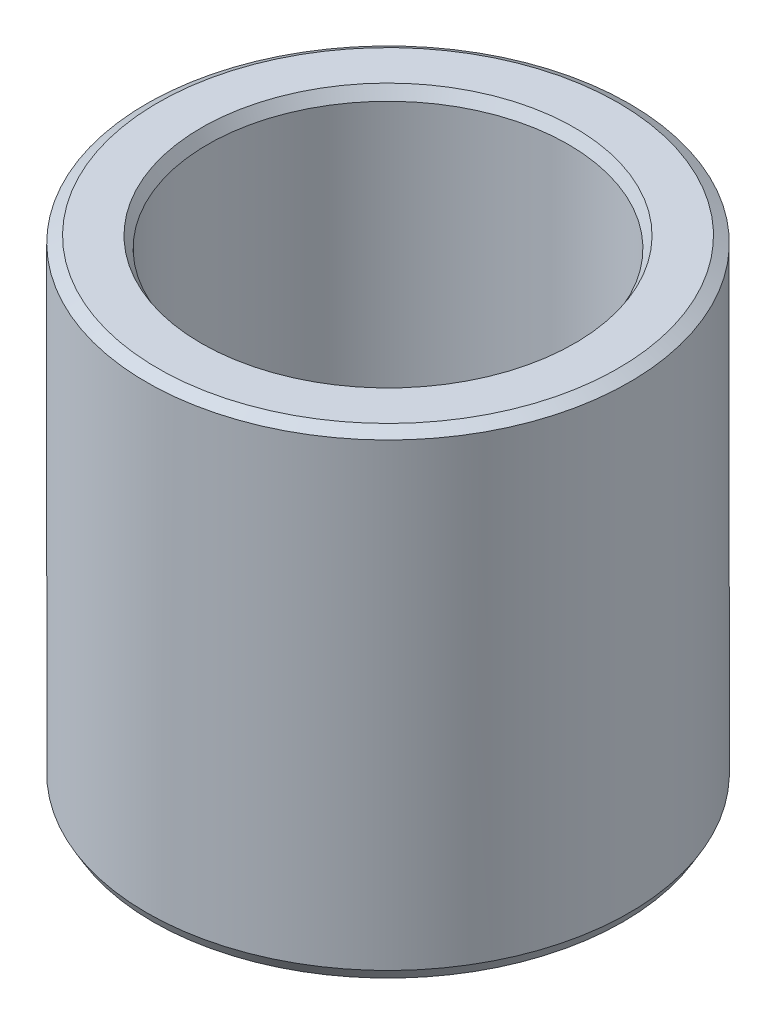
ISO-10303-21;
HEADER;
FILE_DESCRIPTION(('STEP AP214'),'2;1');
FILE_NAME('part.step','',(''),(''),'','','');
FILE_SCHEMA(('AUTOMOTIVE_DESIGN { 1 0 10303 214 1 1 1 1 }'));
ENDSEC;
DATA;
#1=APPLICATION_CONTEXT('core data for automotive mechanical design processes');
#2=APPLICATION_PROTOCOL_DEFINITION('international standard','automotive_design',2000,#1);
#3=PRODUCT_CONTEXT('',#1,'mechanical');
#4=PRODUCT('Part','Part','',(#3));
#5=PRODUCT_RELATED_PRODUCT_CATEGORY('part','',(#4));
#6=PRODUCT_DEFINITION_FORMATION('','',#4);
#7=PRODUCT_DEFINITION_CONTEXT('part definition',#1,'design');
#8=PRODUCT_DEFINITION('design','',#6,#7);
#9=PRODUCT_DEFINITION_SHAPE('','',#8);
#10=(LENGTH_UNIT() NAMED_UNIT(*) SI_UNIT(.MILLI.,.METRE.));
#11=(NAMED_UNIT(*) PLANE_ANGLE_UNIT() SI_UNIT($,.RADIAN.));
#12=(NAMED_UNIT(*) SI_UNIT($,.STERADIAN.) SOLID_ANGLE_UNIT());
#13=UNCERTAINTY_MEASURE_WITH_UNIT(LENGTH_MEASURE(1.E-05),#10,'distance_accuracy_value','');
#14=(GEOMETRIC_REPRESENTATION_CONTEXT(3) GLOBAL_UNCERTAINTY_ASSIGNED_CONTEXT((#13)) GLOBAL_UNIT_ASSIGNED_CONTEXT((#10,
#11,#12)) REPRESENTATION_CONTEXT('',''));
#15=CARTESIAN_POINT('',(0.,0.,0.));
#16=DIRECTION('',(0.,0.,1.));
#17=DIRECTION('',(1.,0.,0.));
#18=AXIS2_PLACEMENT_3D('',#15,#16,#17);
#19=CARTESIAN_POINT('',(0.,113.649586264909,0.));
#20=DIRECTION('',(0.,-1.,0.));
#21=DIRECTION('',(0.,0.,-1.));
#22=AXIS2_PLACEMENT_3D('',#19,#20,#21);
#23=CYLINDRICAL_SURFACE('',#22,57.5);
#24=CARTESIAN_POINT('',(0.,2.66282835838898,0.));
#25=DIRECTION('',(0.,1.,0.));
#26=DIRECTION('',(0.,0.,1.));
#27=AXIS2_PLACEMENT_3D('',#24,#25,#26);
#28=CIRCLE('',#27,57.5);
#29=CARTESIAN_POINT('',(0.,2.66282835838896,-57.5));
#30=VERTEX_POINT('',#29);
#31=EDGE_CURVE('E10',#30,#30,#28,.T.);
#32=CARTESIAN_POINT('',(0.,112.112201595387,0.));
#33=DIRECTION('',(0.,1.,0.));
#34=DIRECTION('',(0.,0.,1.));
#35=AXIS2_PLACEMENT_3D('',#32,#33,#34);
#36=CIRCLE('',#35,57.5);
#37=CARTESIAN_POINT('',(0.,112.112201595387,-57.5));
#38=VERTEX_POINT('',#37);
#39=EDGE_CURVE('E50',#38,#38,#36,.F.);
#40=CARTESIAN_POINT('',(0.,2.66282835838896,-57.5));
#41=CARTESIAN_POINT('',(0.,3.80292599627436,-57.5));
#42=CARTESIAN_POINT('',(0.,4.94302363415976,-57.5));
#43=CARTESIAN_POINT('',(0.,7.22321890993056,-57.5));
#44=CARTESIAN_POINT('',(0.,8.36331654781595,-57.5));
#45=CARTESIAN_POINT('',(0.,10.6435118235867,-57.5));
#46=CARTESIAN_POINT('',(0.,11.7836094614721,-57.5));
#47=CARTESIAN_POINT('',(0.,14.0638047372429,-57.5));
#48=CARTESIAN_POINT('',(0.,15.2039023751283,-57.5));
#49=CARTESIAN_POINT('',(0.,17.4840976508991,-57.5));
#50=CARTESIAN_POINT('',(0.,18.6241952887845,-57.5));
#51=CARTESIAN_POINT('',(0.,20.9043905645553,-57.5));
#52=CARTESIAN_POINT('',(0.,22.0444882024407,-57.5));
#53=CARTESIAN_POINT('',(0.,24.3246834782115,-57.5));
#54=CARTESIAN_POINT('',(0.,25.4647811160969,-57.5));
#55=CARTESIAN_POINT('',(0.,27.7449763918677,-57.5));
#56=CARTESIAN_POINT('',(0.,28.8850740297531,-57.5));
#57=CARTESIAN_POINT('',(0.,31.1652693055239,-57.5));
#58=CARTESIAN_POINT('',(0.,32.3053669434093,-57.5));
#59=CARTESIAN_POINT('',(0.,34.5855622191801,-57.5));
#60=CARTESIAN_POINT('',(0.,35.7256598570655,-57.5));
#61=CARTESIAN_POINT('',(0.,38.0058551328363,-57.5));
#62=CARTESIAN_POINT('',(0.,39.1459527707217,-57.5));
#63=CARTESIAN_POINT('',(0.,41.4261480464925,-57.5));
#64=CARTESIAN_POINT('',(0.,42.5662456843779,-57.5));
#65=CARTESIAN_POINT('',(0.,44.8464409601487,-57.5));
#66=CARTESIAN_POINT('',(0.,45.9865385980341,-57.5));
#67=CARTESIAN_POINT('',(0.,48.2667338738049,-57.5));
#68=CARTESIAN_POINT('',(0.,49.4068315116903,-57.5));
#69=CARTESIAN_POINT('',(0.,51.6870267874611,-57.5));
#70=CARTESIAN_POINT('',(0.,52.8271244253465,-57.5));
#71=CARTESIAN_POINT('',(0.,55.1073197011173,-57.5));
#72=CARTESIAN_POINT('',(0.,56.2474173390027,-57.5));
#73=CARTESIAN_POINT('',(0.,58.5276126147735,-57.5));
#74=CARTESIAN_POINT('',(0.,59.6677102526588,-57.5));
#75=CARTESIAN_POINT('',(0.,61.9479055284296,-57.5));
#76=CARTESIAN_POINT('',(0.,63.088003166315,-57.5));
#77=CARTESIAN_POINT('',(0.,65.3681984420858,-57.5));
#78=CARTESIAN_POINT('',(0.,66.5082960799712,-57.5));
#79=CARTESIAN_POINT('',(0.,68.788491355742,-57.5));
#80=CARTESIAN_POINT('',(0.,69.9285889936274,-57.5));
#81=CARTESIAN_POINT('',(0.,72.2087842693982,-57.5));
#82=CARTESIAN_POINT('',(0.,73.3488819072836,-57.5));
#83=CARTESIAN_POINT('',(0.,75.6290771830544,-57.5));
#84=CARTESIAN_POINT('',(0.,76.7691748209398,-57.5));
#85=CARTESIAN_POINT('',(0.,79.0493700967106,-57.5));
#86=CARTESIAN_POINT('',(0.,80.189467734596,-57.5));
#87=CARTESIAN_POINT('',(0.,82.4696630103668,-57.5));
#88=CARTESIAN_POINT('',(0.,83.6097606482522,-57.5));
#89=CARTESIAN_POINT('',(0.,85.889955924023,-57.5));
#90=CARTESIAN_POINT('',(0.,87.0300535619084,-57.5));
#91=CARTESIAN_POINT('',(0.,89.3102488376792,-57.5));
#92=CARTESIAN_POINT('',(0.,90.4503464755646,-57.5));
#93=CARTESIAN_POINT('',(0.,92.7305417513354,-57.5));
#94=CARTESIAN_POINT('',(0.,93.8706393892208,-57.5));
#95=CARTESIAN_POINT('',(0.,96.1508346649916,-57.5));
#96=CARTESIAN_POINT('',(0.,97.290932302877,-57.5));
#97=CARTESIAN_POINT('',(0.,99.5711275786478,-57.5));
#98=CARTESIAN_POINT('',(0.,100.711225216533,-57.5));
#99=CARTESIAN_POINT('',(0.,102.991420492304,-57.5));
#100=CARTESIAN_POINT('',(0.,104.131518130189,-57.5));
#101=CARTESIAN_POINT('',(0.,106.41171340596,-57.5));
#102=CARTESIAN_POINT('',(0.,107.551811043846,-57.5));
#103=CARTESIAN_POINT('',(0.,109.832006319616,-57.5));
#104=CARTESIAN_POINT('',(0.,110.972103957502,-57.5));
#105=CARTESIAN_POINT('',(0.,112.112201595387,-57.5));
#106=B_SPLINE_CURVE_WITH_KNOTS('',3,(#40,#41,#42,#43,#44,#45,#46,#47,#48,#49,#50,#51,#52,#53,
#54,#55,#56,#57,#58,#59,#60,#61,#62,#63,#64,#65,#66,#67,#68,#69,#70,#71,#72,#73,#74,#75,#76,#77,
#78,#79,#80,#81,#82,#83,#84,#85,#86,#87,#88,#89,#90,#91,#92,#93,#94,#95,#96,#97,#98,#99,#100,
#101,#102,#103,#104,#105),.UNSPECIFIED.,.F.,.F.,(4,2,2,2,2,2,2,2,2,2,2,2,2,2,2,2,2,2,2,2,2,2,2,
2,2,2,2,2,2,2,2,2,4),(0.,3.4202929136562,6.84058582731238,10.2608787409686,13.6811716546248,
17.101464568281,20.5217574819372,23.9420503955934,27.3623433092496,30.7826362229057,
34.2029291365619,37.6232220502181,41.0435149638743,44.4638078775305,47.8841007911867,
51.3043937048429,54.7246866184991,58.1449795321553,61.5652724458115,64.9855653594677,
68.4058582731239,71.8261511867801,75.2464441004362,78.6667370140924,82.0870299277486,
85.5073228414048,88.927615755061,92.3479086687172,95.7682015823734,99.1884944960296,
102.608787409686,106.029080323342,109.449373236998),.UNSPECIFIED.);
#107=EDGE_CURVE('BSEAM39',#30,#38,#106,.T.);
#108=ORIENTED_EDGE('',*,*,#31,.T.);
#109=ORIENTED_EDGE('',*,*,#39,.T.);
#110=ORIENTED_EDGE('',*,*,#107,.T.);
#111=ORIENTED_EDGE('',*,*,#107,.F.);
#112=EDGE_LOOP('',(#108,#110,#109,#111));
#113=FACE_BOUND('',#112,.T.);
#114=ADVANCED_FACE('F39',(#113),#23,.T.);
#115=CARTESIAN_POINT('',(0.,113.649586264909,0.));
#116=DIRECTION('',(0.,1.,0.));
#117=DIRECTION('',(0.,0.,1.));
#118=AXIS2_PLACEMENT_3D('',#115,#116,#117);
#119=PLANE('',#118);
#120=CARTESIAN_POINT('',(0.,113.649586264909,0.));
#121=DIRECTION('',(0.,1.,0.));
#122=DIRECTION('',(0.,0.,1.));
#123=AXIS2_PLACEMENT_3D('',#120,#121,#122);
#124=CIRCLE('',#123,44.485705401805);
#125=CARTESIAN_POINT('',(0.,113.649586264909,44.485705401805));
#126=VERTEX_POINT('',#125);
#127=EDGE_CURVE('E58',#126,#126,#124,.F.);
#128=ORIENTED_EDGE('',*,*,#127,.T.);
#129=EDGE_LOOP('',(#128));
#130=FACE_BOUND('',#129,.T.);
#131=CARTESIAN_POINT('',(0.,113.649586264909,0.));
#132=DIRECTION('',(0.,1.,0.));
#133=DIRECTION('',(0.,0.,1.));
#134=AXIS2_PLACEMENT_3D('',#131,#132,#133);
#135=CIRCLE('',#134,54.8371716416111);
#136=CARTESIAN_POINT('',(0.,113.649586264909,-54.8371716416111));
#137=VERTEX_POINT('',#136);
#138=EDGE_CURVE('E61',#137,#137,#135,.T.);
#139=ORIENTED_EDGE('',*,*,#138,.T.);
#140=EDGE_LOOP('',(#139));
#141=FACE_BOUND('',#140,.T.);
#142=ADVANCED_FACE('F88',(#130,#141),#119,.T.);
#143=CARTESIAN_POINT('',(0.,0.,0.));
#144=DIRECTION('',(0.,1.,0.));
#145=DIRECTION('',(0.,0.,1.));
#146=AXIS2_PLACEMENT_3D('',#143,#144,#145);
#147=PLANE('',#146);
#148=CARTESIAN_POINT('',(0.,0.,0.));
#149=DIRECTION('',(0.,1.,0.));
#150=DIRECTION('',(0.,0.,1.));
#151=AXIS2_PLACEMENT_3D('',#148,#149,#150);
#152=CIRCLE('',#151,45.6111490906723);
#153=CARTESIAN_POINT('',(0.,0.,45.6111490906723));
#154=VERTEX_POINT('',#153);
#155=EDGE_CURVE('E51',#154,#154,#152,.T.);
#156=ORIENTED_EDGE('',*,*,#155,.T.);
#157=EDGE_LOOP('',(#156));
#158=FACE_BOUND('',#157,.T.);
#159=CARTESIAN_POINT('',(0.,0.,0.));
#160=DIRECTION('',(0.,1.,0.));
#161=DIRECTION('',(0.,0.,1.));
#162=AXIS2_PLACEMENT_3D('',#159,#160,#161);
#163=CIRCLE('',#162,55.9626153304783);
#164=CARTESIAN_POINT('',(0.,0.,55.9626153304783));
#165=VERTEX_POINT('',#164);
#166=EDGE_CURVE('E54',#165,#165,#163,.F.);
#167=ORIENTED_EDGE('',*,*,#166,.T.);
#168=EDGE_LOOP('',(#167));
#169=FACE_BOUND('',#168,.T.);
#170=ADVANCED_FACE('F83',(#158,#169),#147,.F.);
#171=CARTESIAN_POINT('',(0.,113.649586264909,0.));
#172=DIRECTION('',(0.,-1.,0.));
#173=DIRECTION('',(0.,0.,-1.));
#174=AXIS2_PLACEMENT_3D('',#171,#172,#173);
#175=CYLINDRICAL_SURFACE('',#174,42.9483207322835);
#176=CARTESIAN_POINT('',(0.,110.98675790652,0.));
#177=DIRECTION('',(0.,1.,0.));
#178=DIRECTION('',(0.,0.,1.));
#179=AXIS2_PLACEMENT_3D('',#176,#177,#178);
#180=CIRCLE('',#179,42.9483207322835);
#181=CARTESIAN_POINT('',(0.,110.98675790652,42.9483207322835));
#182=VERTEX_POINT('',#181);
#183=EDGE_CURVE('E67',#182,#182,#180,.T.);
#184=ORIENTED_EDGE('',*,*,#183,.T.);
#185=EDGE_LOOP('',(#184));
#186=FACE_BOUND('',#185,.T.);
#187=CARTESIAN_POINT('',(0.,1.53738466952161,0.));
#188=DIRECTION('',(0.,1.,0.));
#189=DIRECTION('',(0.,0.,1.));
#190=AXIS2_PLACEMENT_3D('',#187,#188,#189);
#191=CIRCLE('',#190,42.9483207322835);
#192=CARTESIAN_POINT('',(0.,1.53738466952161,42.9483207322835));
#193=VERTEX_POINT('',#192);
#194=EDGE_CURVE('E69',#193,#193,#191,.F.);
#195=ORIENTED_EDGE('',*,*,#194,.T.);
#196=EDGE_LOOP('',(#195));
#197=FACE_BOUND('',#196,.T.);
#198=ADVANCED_FACE('F71',(#186,#197),#175,.F.);
#199=CARTESIAN_POINT('',(0.,110.98675790652,0.));
#200=DIRECTION('',(0.,1.,0.));
#201=DIRECTION('',(0.,0.,1.));
#202=AXIS2_PLACEMENT_3D('',#199,#200,#201);
#203=CONICAL_SURFACE('',#202,42.9483207322835,0.5235987755983);
#204=ORIENTED_EDGE('',*,*,#127,.F.);
#205=EDGE_LOOP('',(#204));
#206=FACE_BOUND('',#205,.T.);
#207=ORIENTED_EDGE('',*,*,#183,.F.);
#208=EDGE_LOOP('',(#207));
#209=FACE_BOUND('',#208,.T.);
#210=ADVANCED_FACE('F77',(#206,#209),#203,.F.);
#211=CARTESIAN_POINT('',(0.,0.,0.));
#212=DIRECTION('',(0.,-1.,0.));
#213=DIRECTION('',(0.,0.,-1.));
#214=AXIS2_PLACEMENT_3D('',#211,#212,#213);
#215=CONICAL_SURFACE('',#214,45.6111490906723,1.04719755119659);
#216=ORIENTED_EDGE('',*,*,#194,.F.);
#217=EDGE_LOOP('',(#216));
#218=FACE_BOUND('',#217,.T.);
#219=ORIENTED_EDGE('',*,*,#155,.F.);
#220=EDGE_LOOP('',(#219));
#221=FACE_BOUND('',#220,.T.);
#222=ADVANCED_FACE('F73',(#218,#221),#215,.F.);
#223=CARTESIAN_POINT('',(0.,2.66282835838898,0.));
#224=DIRECTION('',(0.,1.,0.));
#225=DIRECTION('',(0.,0.,1.));
#226=AXIS2_PLACEMENT_3D('',#223,#224,#225);
#227=CONICAL_SURFACE('',#226,57.5,0.523598775598302);
#228=ORIENTED_EDGE('',*,*,#166,.F.);
#229=EDGE_LOOP('',(#228));
#230=FACE_BOUND('',#229,.T.);
#231=ORIENTED_EDGE('',*,*,#31,.F.);
#232=EDGE_LOOP('',(#231));
#233=FACE_BOUND('',#232,.T.);
#234=ADVANCED_FACE('F76',(#230,#233),#227,.T.);
#235=CARTESIAN_POINT('',(0.,113.649586264909,0.));
#236=DIRECTION('',(0.,-1.,0.));
#237=DIRECTION('',(0.,0.,-1.));
#238=AXIS2_PLACEMENT_3D('',#235,#236,#237);
#239=CONICAL_SURFACE('',#238,54.8371716416111,1.04719755119659);
#240=CARTESIAN_POINT('',(0.,112.112201595387,-57.5));
#241=CARTESIAN_POINT('',(0.,112.128216019028,-57.4722622046001));
#242=CARTESIAN_POINT('',(0.,112.144230442669,-57.4445244092002));
#243=CARTESIAN_POINT('',(0.,112.176259289951,-57.3890488184005));
#244=CARTESIAN_POINT('',(0.,112.192273713591,-57.3613110230006));
#245=CARTESIAN_POINT('',(0.,112.224302560873,-57.3058354322008));
#246=CARTESIAN_POINT('',(0.,112.240316984514,-57.2780976368009));
#247=CARTESIAN_POINT('',(0.,112.272345831796,-57.2226220460012));
#248=CARTESIAN_POINT('',(0.,112.288360255437,-57.1948842506013));
#249=CARTESIAN_POINT('',(0.,112.320389102718,-57.1394086598015));
#250=CARTESIAN_POINT('',(0.,112.336403526359,-57.1116708644016));
#251=CARTESIAN_POINT('',(0.,112.368432373641,-57.0561952736019));
#252=CARTESIAN_POINT('',(0.,112.384446797282,-57.028457478202));
#253=CARTESIAN_POINT('',(0.,112.416475644563,-56.9729818874022));
#254=CARTESIAN_POINT('',(0.,112.432490068204,-56.9452440920023));
#255=CARTESIAN_POINT('',(0.,112.464518915486,-56.8897685012026));
#256=CARTESIAN_POINT('',(0.,112.480533339127,-56.8620307058027));
#257=CARTESIAN_POINT('',(0.,112.512562186408,-56.8065551150029));
#258=CARTESIAN_POINT('',(0.,112.528576610049,-56.778817319603));
#259=CARTESIAN_POINT('',(0.,112.560605457331,-56.7233417288033));
#260=CARTESIAN_POINT('',(0.,112.576619880972,-56.6956039334034));
#261=CARTESIAN_POINT('',(0.,112.608648728254,-56.6401283426036));
#262=CARTESIAN_POINT('',(0.,112.624663151894,-56.6123905472037));
#263=CARTESIAN_POINT('',(0.,112.656691999176,-56.556914956404));
#264=CARTESIAN_POINT('',(0.,112.672706422817,-56.5291771610041));
#265=CARTESIAN_POINT('',(0.,112.704735270099,-56.4737015702043));
#266=CARTESIAN_POINT('',(0.,112.720749693739,-56.4459637748044));
#267=CARTESIAN_POINT('',(0.,112.752778541021,-56.3904881840046));
#268=CARTESIAN_POINT('',(0.,112.768792964662,-56.3627503886048));
#269=CARTESIAN_POINT('',(0.,112.800821811944,-56.307274797805));
#270=CARTESIAN_POINT('',(0.,112.816836235585,-56.2795370024051));
#271=CARTESIAN_POINT('',(0.,112.848865082866,-56.2240614116053));
#272=CARTESIAN_POINT('',(0.,112.864879506507,-56.1963236162055));
#273=CARTESIAN_POINT('',(0.,112.896908353789,-56.1408480254057));
#274=CARTESIAN_POINT('',(0.,112.91292277743,-56.1131102300058));
#275=CARTESIAN_POINT('',(0.,112.944951624711,-56.057634639206));
#276=CARTESIAN_POINT('',(0.,112.960966048352,-56.0298968438061));
#277=CARTESIAN_POINT('',(0.,112.992994895634,-55.9744212530064));
#278=CARTESIAN_POINT('',(0.,113.009009319275,-55.9466834576065));
#279=CARTESIAN_POINT('',(0.,113.041038166556,-55.8912078668067));
#280=CARTESIAN_POINT('',(0.,113.057052590197,-55.8634700714069));
#281=CARTESIAN_POINT('',(0.,113.089081437479,-55.8079944806071));
#282=CARTESIAN_POINT('',(0.,113.10509586112,-55.7802566852072));
#283=CARTESIAN_POINT('',(0.,113.137124708402,-55.7247810944074));
#284=CARTESIAN_POINT('',(0.,113.153139132042,-55.6970432990075));
#285=CARTESIAN_POINT('',(0.,113.185167979324,-55.6415677082078));
#286=CARTESIAN_POINT('',(0.,113.201182402965,-55.6138299128079));
#287=CARTESIAN_POINT('',(0.,113.233211250247,-55.5583543220081));
#288=CARTESIAN_POINT('',(0.,113.249225673888,-55.5306165266082));
#289=CARTESIAN_POINT('',(0.,113.281254521169,-55.4751409358085));
#290=CARTESIAN_POINT('',(0.,113.29726894481,-55.4474031404086));
#291=CARTESIAN_POINT('',(0.,113.329297792092,-55.3919275496088));
#292=CARTESIAN_POINT('',(0.,113.345312215733,-55.3641897542089));
#293=CARTESIAN_POINT('',(0.,113.377341063014,-55.3087141634092));
#294=CARTESIAN_POINT('',(0.,113.393355486655,-55.2809763680093));
#295=CARTESIAN_POINT('',(0.,113.425384333937,-55.2255007772095));
#296=CARTESIAN_POINT('',(0.,113.441398757578,-55.1977629818096));
#297=CARTESIAN_POINT('',(0.,113.473427604859,-55.1422873910099));
#298=CARTESIAN_POINT('',(0.,113.4894420285,-55.11454959561));
#299=CARTESIAN_POINT('',(0.,113.521470875782,-55.0590740048102));
#300=CARTESIAN_POINT('',(0.,113.537485299423,-55.0313362094103));
#301=CARTESIAN_POINT('',(0.,113.569514146705,-54.9758606186106));
#302=CARTESIAN_POINT('',(0.,113.585528570345,-54.9481228232107));
#303=CARTESIAN_POINT('',(0.,113.617557417627,-54.8926472324109));
#304=CARTESIAN_POINT('',(0.,113.633571841268,-54.864909437011));
#305=CARTESIAN_POINT('',(0.,113.649586264909,-54.8371716416111));
#306=B_SPLINE_CURVE_WITH_KNOTS('',3,(#240,#241,#242,#243,#244,#245,#246,#247,#248,#249,#250,
#251,#252,#253,#254,#255,#256,#257,#258,#259,#260,#261,#262,#263,#264,#265,#266,#267,#268,#269,
#270,#271,#272,#273,#274,#275,#276,#277,#278,#279,#280,#281,#282,#283,#284,#285,#286,#287,#288,
#289,#290,#291,#292,#293,#294,#295,#296,#297,#298,#299,#300,#301,#302,#303,#304,#305),
.UNSPECIFIED.,.F.,.F.,(4,2,2,2,2,2,2,2,2,2,2,2,2,2,2,2,2,2,2,2,2,2,2,2,2,2,2,2,2,2,2,2,4),(0.,
0.0960865418450989,0.192173083690198,0.288259625535298,0.384346167380397,0.480432709225496,
0.576519251070602,0.6726057929157,0.768692334760793,0.864778876605899,0.960865418450998,
1.05695196029609,1.1530385021412,1.2491250439863,1.34521158583139,1.4412981276765,
1.53738466952159,1.63347121136669,1.7295577532118,1.82564429505689,1.92173083690199,
2.0178173787471,2.1139039205922,2.20999046243729,2.30607700428239,2.40216354612749,
2.49825008797259,2.5943366298177,2.69042317166279,2.78650971350789,2.88259625535299,
2.97868279719809,3.07476933904319),.UNSPECIFIED.);
#307=EDGE_CURVE('BSEAM45',#38,#137,#306,.T.);
#308=ORIENTED_EDGE('',*,*,#39,.F.);
#309=ORIENTED_EDGE('',*,*,#138,.F.);
#310=ORIENTED_EDGE('',*,*,#307,.T.);
#311=ORIENTED_EDGE('',*,*,#307,.F.);
#312=EDGE_LOOP('',(#308,#310,#309,#311));
#313=FACE_BOUND('',#312,.T.);
#314=ADVANCED_FACE('F45',(#313),#239,.T.);
#315=CLOSED_SHELL('',(#114,#142,#170,#198,#210,#222,#234,#314));
#316=MANIFOLD_SOLID_BREP('B2',#315);
#317=ADVANCED_BREP_SHAPE_REPRESENTATION('',(#18,#316),#14);
#318=SHAPE_DEFINITION_REPRESENTATION(#9,#317);
ENDSEC;
END-ISO-10303-21;
